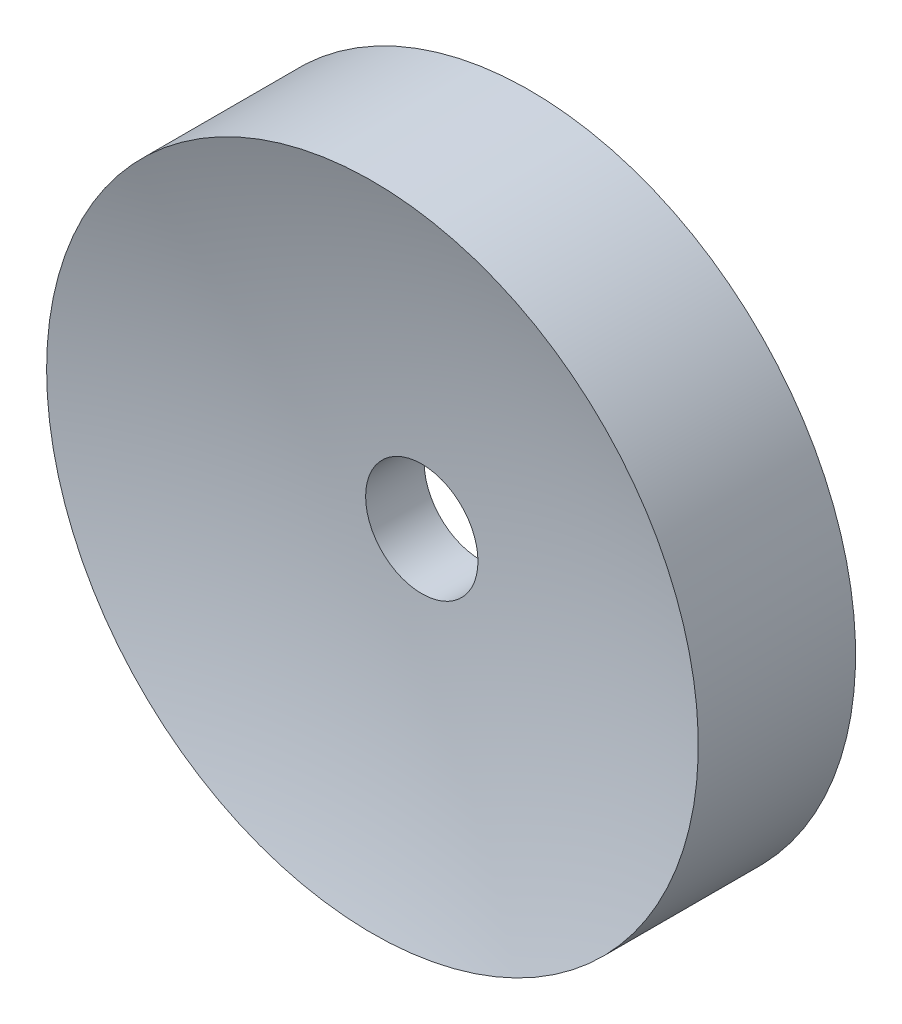
ISO-10303-21;
HEADER;
FILE_DESCRIPTION(('STEP AP214'),'2;1');
FILE_NAME('part.step','',(''),(''),'','','');
FILE_SCHEMA(('AUTOMOTIVE_DESIGN { 1 0 10303 214 1 1 1 1 }'));
ENDSEC;
DATA;
#1=APPLICATION_CONTEXT('core data for automotive mechanical design processes');
#2=APPLICATION_PROTOCOL_DEFINITION('international standard','automotive_design',2000,#1);
#3=PRODUCT_CONTEXT('',#1,'mechanical');
#4=PRODUCT('Part','Part','',(#3));
#5=PRODUCT_RELATED_PRODUCT_CATEGORY('part','',(#4));
#6=PRODUCT_DEFINITION_FORMATION('','',#4);
#7=PRODUCT_DEFINITION_CONTEXT('part definition',#1,'design');
#8=PRODUCT_DEFINITION('design','',#6,#7);
#9=PRODUCT_DEFINITION_SHAPE('','',#8);
#10=(LENGTH_UNIT() NAMED_UNIT(*) SI_UNIT(.MILLI.,.METRE.));
#11=(NAMED_UNIT(*) PLANE_ANGLE_UNIT() SI_UNIT($,.RADIAN.));
#12=(NAMED_UNIT(*) SI_UNIT($,.STERADIAN.) SOLID_ANGLE_UNIT());
#13=UNCERTAINTY_MEASURE_WITH_UNIT(LENGTH_MEASURE(1.E-05),#10,'distance_accuracy_value','');
#14=(GEOMETRIC_REPRESENTATION_CONTEXT(3) GLOBAL_UNCERTAINTY_ASSIGNED_CONTEXT((#13)) GLOBAL_UNIT_ASSIGNED_CONTEXT((#10,
#11,#12)) REPRESENTATION_CONTEXT('',''));
#15=CARTESIAN_POINT('',(0.,0.,0.));
#16=DIRECTION('',(0.,0.,1.));
#17=DIRECTION('',(1.,0.,0.));
#18=AXIS2_PLACEMENT_3D('',#15,#16,#17);
#19=CARTESIAN_POINT('',(0.,0.,1.75));
#20=DIRECTION('',(0.,0.,-1.));
#21=DIRECTION('',(-1.,0.,0.));
#22=AXIS2_PLACEMENT_3D('',#19,#20,#21);
#23=CYLINDRICAL_SURFACE('',#22,1.25);
#24=CARTESIAN_POINT('',(0.,0.,-0.651865141234716));
#25=DIRECTION('',(0.,0.,-1.));
#26=DIRECTION('',(-1.,0.,0.));
#27=AXIS2_PLACEMENT_3D('',#24,#25,#26);
#28=CIRCLE('',#27,1.25);
#29=CARTESIAN_POINT('',(-1.25,0.,-0.651865141234716));
#30=VERTEX_POINT('',#29);
#31=EDGE_CURVE('E10',#30,#30,#28,.T.);
#32=ORIENTED_EDGE('',*,*,#31,.T.);
#33=EDGE_LOOP('',(#32));
#34=FACE_BOUND('',#33,.T.);
#35=CARTESIAN_POINT('',(0.,0.,0.651865141234716));
#36=DIRECTION('',(0.,0.,1.));
#37=DIRECTION('',(1.,0.,0.));
#38=AXIS2_PLACEMENT_3D('',#35,#36,#37);
#39=CIRCLE('',#38,1.25);
#40=CARTESIAN_POINT('',(1.25,0.,0.651865141234716));
#41=VERTEX_POINT('',#40);
#42=EDGE_CURVE('E44',#41,#41,#39,.T.);
#43=ORIENTED_EDGE('',*,*,#42,.T.);
#44=EDGE_LOOP('',(#43));
#45=FACE_BOUND('',#44,.T.);
#46=ADVANCED_FACE('F33',(#34,#45),#23,.F.);
#47=CARTESIAN_POINT('',(0.,0.,1.75));
#48=DIRECTION('',(0.,0.,-1.));
#49=DIRECTION('',(-1.,0.,0.));
#50=AXIS2_PLACEMENT_3D('',#47,#48,#49);
#51=CYLINDRICAL_SURFACE('',#50,7.25);
#52=CARTESIAN_POINT('',(0.,0.,1.75));
#53=DIRECTION('',(0.,0.,-1.));
#54=DIRECTION('',(-1.,0.,0.));
#55=AXIS2_PLACEMENT_3D('',#52,#53,#54);
#56=CIRCLE('',#55,7.25);
#57=CARTESIAN_POINT('',(-7.25,0.,1.75));
#58=VERTEX_POINT('',#57);
#59=EDGE_CURVE('E48',#58,#58,#56,.T.);
#60=ORIENTED_EDGE('',*,*,#59,.T.);
#61=EDGE_LOOP('',(#60));
#62=FACE_BOUND('',#61,.T.);
#63=CARTESIAN_POINT('',(0.,0.,-1.75));
#64=DIRECTION('',(0.,0.,-1.));
#65=DIRECTION('',(-1.,0.,0.));
#66=AXIS2_PLACEMENT_3D('',#63,#64,#65);
#67=CIRCLE('',#66,7.25);
#68=CARTESIAN_POINT('',(-7.25,0.,-1.75));
#69=VERTEX_POINT('',#68);
#70=EDGE_CURVE('E40',#69,#69,#67,.T.);
#71=ORIENTED_EDGE('',*,*,#70,.F.);
#72=EDGE_LOOP('',(#71));
#73=FACE_BOUND('',#72,.T.);
#74=ADVANCED_FACE('F35',(#62,#73),#51,.T.);
#75=CARTESIAN_POINT('',(0.,0.,-24.4221242088388));
#76=DIRECTION('',(0.,0.,-1.));
#77=DIRECTION('',(1.,0.,0.));
#78=AXIS2_PLACEMENT_3D('',#75,#76,#77);
#79=SPHERICAL_SURFACE('',#78,23.8031030779815);
#80=ORIENTED_EDGE('',*,*,#31,.F.);
#81=EDGE_LOOP('',(#80));
#82=FACE_BOUND('',#81,.T.);
#83=ORIENTED_EDGE('',*,*,#70,.T.);
#84=EDGE_LOOP('',(#83));
#85=FACE_BOUND('',#84,.T.);
#86=ADVANCED_FACE('F58',(#82,#85),#79,.F.);
#87=CARTESIAN_POINT('',(0.,0.,24.4221242088388));
#88=DIRECTION('',(0.,0.,1.));
#89=DIRECTION('',(1.,0.,0.));
#90=AXIS2_PLACEMENT_3D('',#87,#88,#89);
#91=SPHERICAL_SURFACE('',#90,23.8031030779815);
#92=ORIENTED_EDGE('',*,*,#42,.F.);
#93=EDGE_LOOP('',(#92));
#94=FACE_BOUND('',#93,.T.);
#95=ORIENTED_EDGE('',*,*,#59,.F.);
#96=EDGE_LOOP('',(#95));
#97=FACE_BOUND('',#96,.T.);
#98=ADVANCED_FACE('F56',(#94,#97),#91,.F.);
#99=CLOSED_SHELL('',(#46,#74,#86,#98));
#100=MANIFOLD_SOLID_BREP('B2',#99);
#101=ADVANCED_BREP_SHAPE_REPRESENTATION('',(#18,#100),#14);
#102=SHAPE_DEFINITION_REPRESENTATION(#9,#101);
ENDSEC;
END-ISO-10303-21;
